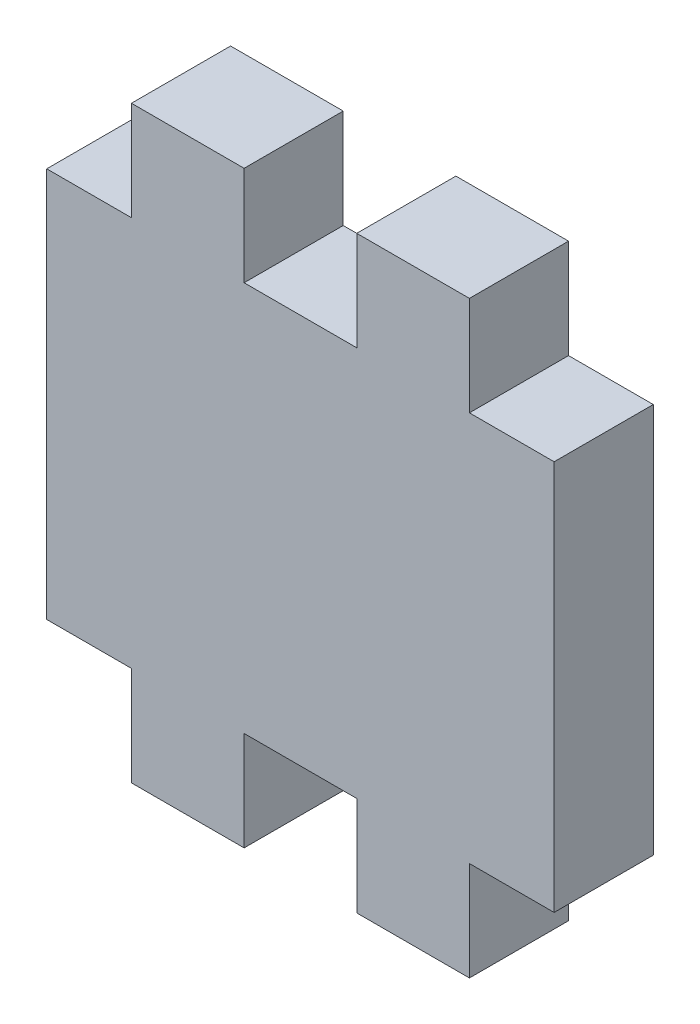
ISO-10303-21;
HEADER;
FILE_DESCRIPTION(('STEP AP214'),'2;1');
FILE_NAME('part.step','',(''),(''),'','','');
FILE_SCHEMA(('AUTOMOTIVE_DESIGN { 1 0 10303 214 1 1 1 1 }'));
ENDSEC;
DATA;
#1=APPLICATION_CONTEXT('core data for automotive mechanical design processes');
#2=APPLICATION_PROTOCOL_DEFINITION('international standard','automotive_design',2000,#1);
#3=PRODUCT_CONTEXT('',#1,'mechanical');
#4=PRODUCT('Part','Part','',(#3));
#5=PRODUCT_RELATED_PRODUCT_CATEGORY('part','',(#4));
#6=PRODUCT_DEFINITION_FORMATION('','',#4);
#7=PRODUCT_DEFINITION_CONTEXT('part definition',#1,'design');
#8=PRODUCT_DEFINITION('design','',#6,#7);
#9=PRODUCT_DEFINITION_SHAPE('','',#8);
#10=(LENGTH_UNIT() NAMED_UNIT(*) SI_UNIT(.MILLI.,.METRE.));
#11=(NAMED_UNIT(*) PLANE_ANGLE_UNIT() SI_UNIT($,.RADIAN.));
#12=(NAMED_UNIT(*) SI_UNIT($,.STERADIAN.) SOLID_ANGLE_UNIT());
#13=UNCERTAINTY_MEASURE_WITH_UNIT(LENGTH_MEASURE(1.E-05),#10,'distance_accuracy_value','');
#14=(GEOMETRIC_REPRESENTATION_CONTEXT(3) GLOBAL_UNCERTAINTY_ASSIGNED_CONTEXT((#13)) GLOBAL_UNIT_ASSIGNED_CONTEXT((#10,
#11,#12)) REPRESENTATION_CONTEXT('',''));
#15=CARTESIAN_POINT('',(0.,0.,0.));
#16=DIRECTION('',(0.,0.,1.));
#17=DIRECTION('',(1.,0.,0.));
#18=AXIS2_PLACEMENT_3D('',#15,#16,#17);
#19=CARTESIAN_POINT('',(0.,0.,5.588));
#20=DIRECTION('',(1.,0.,0.));
#21=DIRECTION('',(0.,0.,-1.));
#22=AXIS2_PLACEMENT_3D('',#19,#20,#21);
#23=PLANE('',#22);
#24=DIRECTION('',(0.,-1.,0.));
#25=VECTOR('',#24,1.);
#26=CARTESIAN_POINT('',(0.,0.,0.));
#27=LINE('',#26,#25);
#28=CARTESIAN_POINT('',(0.,22.,0.));
#29=VERTEX_POINT('',#28);
#30=CARTESIAN_POINT('',(0.,0.,0.));
#31=VERTEX_POINT('',#30);
#32=EDGE_CURVE('E201',#29,#31,#27,.T.);
#33=ORIENTED_EDGE('',*,*,#32,.T.);
#34=DIRECTION('',(0.,0.,-1.));
#35=VECTOR('',#34,1.);
#36=CARTESIAN_POINT('',(0.,0.,5.588));
#37=LINE('',#36,#35);
#38=CARTESIAN_POINT('',(0.,0.,5.588));
#39=VERTEX_POINT('',#38);
#40=EDGE_CURVE('E11',#39,#31,#37,.T.);
#41=ORIENTED_EDGE('',*,*,#40,.F.);
#42=DIRECTION('',(0.,-1.,0.));
#43=VECTOR('',#42,1.);
#44=CARTESIAN_POINT('',(0.,0.,5.588));
#45=LINE('',#44,#43);
#46=CARTESIAN_POINT('',(0.,22.,5.588));
#47=VERTEX_POINT('',#46);
#48=EDGE_CURVE('E239',#47,#39,#45,.T.);
#49=ORIENTED_EDGE('',*,*,#48,.F.);
#50=DIRECTION('',(0.,0.,-1.));
#51=VECTOR('',#50,1.);
#52=CARTESIAN_POINT('',(0.,22.,5.588));
#53=LINE('',#52,#51);
#54=EDGE_CURVE('E197',#47,#29,#53,.T.);
#55=ORIENTED_EDGE('',*,*,#54,.T.);
#56=EDGE_LOOP('',(#33,#41,#49,#55));
#57=FACE_BOUND('',#56,.T.);
#58=ADVANCED_FACE('F33',(#57),#23,.F.);
#59=CARTESIAN_POINT('',(0.,0.,5.588));
#60=DIRECTION('',(0.,1.,0.));
#61=DIRECTION('',(-1.,0.,0.));
#62=AXIS2_PLACEMENT_3D('',#59,#60,#61);
#63=PLANE('',#62);
#64=DIRECTION('',(1.,0.,0.));
#65=VECTOR('',#64,1.);
#66=CARTESIAN_POINT('',(0.,0.,0.));
#67=LINE('',#66,#65);
#68=CARTESIAN_POINT('',(4.77500000000001,0.,0.));
#69=VERTEX_POINT('',#68);
#70=EDGE_CURVE('E204',#31,#69,#67,.T.);
#71=ORIENTED_EDGE('',*,*,#70,.T.);
#72=DIRECTION('',(0.,0.,-1.));
#73=VECTOR('',#72,1.);
#74=CARTESIAN_POINT('',(4.77500000000001,0.,5.588));
#75=LINE('',#74,#73);
#76=CARTESIAN_POINT('',(4.77500000000001,0.,5.588));
#77=VERTEX_POINT('',#76);
#78=EDGE_CURVE('E41',#77,#69,#75,.T.);
#79=ORIENTED_EDGE('',*,*,#78,.F.);
#80=DIRECTION('',(1.,0.,0.));
#81=VECTOR('',#80,1.);
#82=CARTESIAN_POINT('',(0.,0.,5.588));
#83=LINE('',#82,#81);
#84=EDGE_CURVE('E128',#39,#77,#83,.T.);
#85=ORIENTED_EDGE('',*,*,#84,.F.);
#86=ORIENTED_EDGE('',*,*,#40,.T.);
#87=EDGE_LOOP('',(#71,#79,#85,#86));
#88=FACE_BOUND('',#87,.T.);
#89=ADVANCED_FACE('F357',(#88),#63,.F.);
#90=CARTESIAN_POINT('',(4.77500000000001,0.,5.588));
#91=DIRECTION('',(1.,0.,0.));
#92=DIRECTION('',(0.,1.,0.));
#93=AXIS2_PLACEMENT_3D('',#90,#91,#92);
#94=PLANE('',#93);
#95=DIRECTION('',(0.,-1.,0.));
#96=VECTOR('',#95,1.);
#97=CARTESIAN_POINT('',(4.77500000000001,0.,0.));
#98=LINE('',#97,#96);
#99=CARTESIAN_POINT('',(4.77500000000001,-5.588,0.));
#100=VERTEX_POINT('',#99);
#101=EDGE_CURVE('E206',#69,#100,#98,.T.);
#102=ORIENTED_EDGE('',*,*,#101,.T.);
#103=DIRECTION('',(0.,0.,-1.));
#104=VECTOR('',#103,1.);
#105=CARTESIAN_POINT('',(4.77500000000001,-5.588,5.588));
#106=LINE('',#105,#104);
#107=CARTESIAN_POINT('',(4.77500000000001,-5.588,5.588));
#108=VERTEX_POINT('',#107);
#109=EDGE_CURVE('E282',#108,#100,#106,.T.);
#110=ORIENTED_EDGE('',*,*,#109,.F.);
#111=DIRECTION('',(0.,-1.,0.));
#112=VECTOR('',#111,1.);
#113=CARTESIAN_POINT('',(4.77500000000001,0.,5.588));
#114=LINE('',#113,#112);
#115=EDGE_CURVE('E290',#77,#108,#114,.T.);
#116=ORIENTED_EDGE('',*,*,#115,.F.);
#117=ORIENTED_EDGE('',*,*,#78,.T.);
#118=EDGE_LOOP('',(#102,#110,#116,#117));
#119=FACE_BOUND('',#118,.T.);
#120=ADVANCED_FACE('F288',(#119),#94,.F.);
#121=CARTESIAN_POINT('',(4.77500000000001,-5.588,5.588));
#122=DIRECTION('',(0.,1.,0.));
#123=DIRECTION('',(0.,0.,1.));
#124=AXIS2_PLACEMENT_3D('',#121,#122,#123);
#125=PLANE('',#124);
#126=DIRECTION('',(1.,0.,0.));
#127=VECTOR('',#126,1.);
#128=CARTESIAN_POINT('',(4.77500000000001,-5.588,0.));
#129=LINE('',#128,#127);
#130=CARTESIAN_POINT('',(11.125,-5.588,0.));
#131=VERTEX_POINT('',#130);
#132=EDGE_CURVE('E208',#100,#131,#129,.T.);
#133=ORIENTED_EDGE('',*,*,#132,.T.);
#134=DIRECTION('',(0.,0.,-1.));
#135=VECTOR('',#134,1.);
#136=CARTESIAN_POINT('',(11.125,-5.588,5.588));
#137=LINE('',#136,#135);
#138=CARTESIAN_POINT('',(11.125,-5.588,5.588));
#139=VERTEX_POINT('',#138);
#140=EDGE_CURVE('E279',#139,#131,#137,.T.);
#141=ORIENTED_EDGE('',*,*,#140,.F.);
#142=DIRECTION('',(1.,0.,0.));
#143=VECTOR('',#142,1.);
#144=CARTESIAN_POINT('',(4.77500000000001,-5.588,5.588));
#145=LINE('',#144,#143);
#146=EDGE_CURVE('E308',#108,#139,#145,.T.);
#147=ORIENTED_EDGE('',*,*,#146,.F.);
#148=ORIENTED_EDGE('',*,*,#109,.T.);
#149=EDGE_LOOP('',(#133,#141,#147,#148));
#150=FACE_BOUND('',#149,.T.);
#151=ADVANCED_FACE('F299',(#150),#125,.F.);
#152=CARTESIAN_POINT('',(11.125,0.,5.588));
#153=DIRECTION('',(-1.,0.,0.));
#154=DIRECTION('',(0.,0.,1.));
#155=AXIS2_PLACEMENT_3D('',#152,#153,#154);
#156=PLANE('',#155);
#157=DIRECTION('',(0.,1.,0.));
#158=VECTOR('',#157,1.);
#159=CARTESIAN_POINT('',(11.125,0.,0.));
#160=LINE('',#159,#158);
#161=CARTESIAN_POINT('',(11.125,0.,0.));
#162=VERTEX_POINT('',#161);
#163=EDGE_CURVE('E210',#131,#162,#160,.T.);
#164=ORIENTED_EDGE('',*,*,#163,.T.);
#165=DIRECTION('',(0.,0.,-1.));
#166=VECTOR('',#165,1.);
#167=CARTESIAN_POINT('',(11.125,0.,5.588));
#168=LINE('',#167,#166);
#169=CARTESIAN_POINT('',(11.125,0.,5.588));
#170=VERTEX_POINT('',#169);
#171=EDGE_CURVE('E276',#170,#162,#168,.T.);
#172=ORIENTED_EDGE('',*,*,#171,.F.);
#173=DIRECTION('',(0.,1.,0.));
#174=VECTOR('',#173,1.);
#175=CARTESIAN_POINT('',(11.125,0.,5.588));
#176=LINE('',#175,#174);
#177=EDGE_CURVE('E305',#139,#170,#176,.T.);
#178=ORIENTED_EDGE('',*,*,#177,.F.);
#179=ORIENTED_EDGE('',*,*,#140,.T.);
#180=EDGE_LOOP('',(#164,#172,#178,#179));
#181=FACE_BOUND('',#180,.T.);
#182=ADVANCED_FACE('F303',(#181),#156,.F.);
#183=CARTESIAN_POINT('',(11.125,0.,5.588));
#184=DIRECTION('',(0.,1.,0.));
#185=DIRECTION('',(0.,0.,1.));
#186=AXIS2_PLACEMENT_3D('',#183,#184,#185);
#187=PLANE('',#186);
#188=DIRECTION('',(1.,0.,0.));
#189=VECTOR('',#188,1.);
#190=CARTESIAN_POINT('',(11.125,0.,0.));
#191=LINE('',#190,#189);
#192=CARTESIAN_POINT('',(17.475,0.,0.));
#193=VERTEX_POINT('',#192);
#194=EDGE_CURVE('E212',#162,#193,#191,.T.);
#195=ORIENTED_EDGE('',*,*,#194,.T.);
#196=DIRECTION('',(0.,0.,-1.));
#197=VECTOR('',#196,1.);
#198=CARTESIAN_POINT('',(17.475,0.,5.588));
#199=LINE('',#198,#197);
#200=CARTESIAN_POINT('',(17.475,0.,5.588));
#201=VERTEX_POINT('',#200);
#202=EDGE_CURVE('E273',#201,#193,#199,.T.);
#203=ORIENTED_EDGE('',*,*,#202,.F.);
#204=DIRECTION('',(1.,0.,0.));
#205=VECTOR('',#204,1.);
#206=CARTESIAN_POINT('',(11.125,0.,5.588));
#207=LINE('',#206,#205);
#208=EDGE_CURVE('E307',#170,#201,#207,.T.);
#209=ORIENTED_EDGE('',*,*,#208,.F.);
#210=ORIENTED_EDGE('',*,*,#171,.T.);
#211=EDGE_LOOP('',(#195,#203,#209,#210));
#212=FACE_BOUND('',#211,.T.);
#213=ADVANCED_FACE('F370',(#212),#187,.F.);
#214=CARTESIAN_POINT('',(17.475,0.,5.588));
#215=DIRECTION('',(1.,0.,0.));
#216=DIRECTION('',(0.,0.,-1.));
#217=AXIS2_PLACEMENT_3D('',#214,#215,#216);
#218=PLANE('',#217);
#219=DIRECTION('',(0.,-1.,0.));
#220=VECTOR('',#219,1.);
#221=CARTESIAN_POINT('',(17.475,0.,0.));
#222=LINE('',#221,#220);
#223=CARTESIAN_POINT('',(17.475,-5.588,0.));
#224=VERTEX_POINT('',#223);
#225=EDGE_CURVE('E214',#193,#224,#222,.T.);
#226=ORIENTED_EDGE('',*,*,#225,.T.);
#227=DIRECTION('',(0.,0.,-1.));
#228=VECTOR('',#227,1.);
#229=CARTESIAN_POINT('',(17.475,-5.588,5.588));
#230=LINE('',#229,#228);
#231=CARTESIAN_POINT('',(17.475,-5.588,5.588));
#232=VERTEX_POINT('',#231);
#233=EDGE_CURVE('E270',#232,#224,#230,.T.);
#234=ORIENTED_EDGE('',*,*,#233,.F.);
#235=DIRECTION('',(0.,-1.,0.));
#236=VECTOR('',#235,1.);
#237=CARTESIAN_POINT('',(17.475,0.,5.588));
#238=LINE('',#237,#236);
#239=EDGE_CURVE('E310',#201,#232,#238,.T.);
#240=ORIENTED_EDGE('',*,*,#239,.F.);
#241=ORIENTED_EDGE('',*,*,#202,.T.);
#242=EDGE_LOOP('',(#226,#234,#240,#241));
#243=FACE_BOUND('',#242,.T.);
#244=ADVANCED_FACE('F373',(#243),#218,.F.);
#245=CARTESIAN_POINT('',(17.475,-5.588,5.588));
#246=DIRECTION('',(0.,1.,0.));
#247=DIRECTION('',(0.,0.,1.));
#248=AXIS2_PLACEMENT_3D('',#245,#246,#247);
#249=PLANE('',#248);
#250=DIRECTION('',(1.,0.,0.));
#251=VECTOR('',#250,1.);
#252=CARTESIAN_POINT('',(17.475,-5.588,0.));
#253=LINE('',#252,#251);
#254=CARTESIAN_POINT('',(23.825,-5.588,0.));
#255=VERTEX_POINT('',#254);
#256=EDGE_CURVE('E216',#224,#255,#253,.T.);
#257=ORIENTED_EDGE('',*,*,#256,.T.);
#258=DIRECTION('',(0.,0.,-1.));
#259=VECTOR('',#258,1.);
#260=CARTESIAN_POINT('',(23.825,-5.588,5.588));
#261=LINE('',#260,#259);
#262=CARTESIAN_POINT('',(23.825,-5.588,5.588));
#263=VERTEX_POINT('',#262);
#264=EDGE_CURVE('E267',#263,#255,#261,.T.);
#265=ORIENTED_EDGE('',*,*,#264,.F.);
#266=DIRECTION('',(1.,0.,0.));
#267=VECTOR('',#266,1.);
#268=CARTESIAN_POINT('',(17.475,-5.588,5.588));
#269=LINE('',#268,#267);
#270=EDGE_CURVE('E316',#232,#263,#269,.T.);
#271=ORIENTED_EDGE('',*,*,#270,.F.);
#272=ORIENTED_EDGE('',*,*,#233,.T.);
#273=EDGE_LOOP('',(#257,#265,#271,#272));
#274=FACE_BOUND('',#273,.T.);
#275=ADVANCED_FACE('F377',(#274),#249,.F.);
#276=CARTESIAN_POINT('',(23.825,0.,5.588));
#277=DIRECTION('',(-1.,0.,0.));
#278=DIRECTION('',(0.,0.,1.));
#279=AXIS2_PLACEMENT_3D('',#276,#277,#278);
#280=PLANE('',#279);
#281=DIRECTION('',(0.,1.,0.));
#282=VECTOR('',#281,1.);
#283=CARTESIAN_POINT('',(23.825,0.,0.));
#284=LINE('',#283,#282);
#285=CARTESIAN_POINT('',(23.825,0.,0.));
#286=VERTEX_POINT('',#285);
#287=EDGE_CURVE('E218',#255,#286,#284,.T.);
#288=ORIENTED_EDGE('',*,*,#287,.T.);
#289=DIRECTION('',(0.,0.,-1.));
#290=VECTOR('',#289,1.);
#291=CARTESIAN_POINT('',(23.825,0.,5.588));
#292=LINE('',#291,#290);
#293=CARTESIAN_POINT('',(23.825,0.,5.588));
#294=VERTEX_POINT('',#293);
#295=EDGE_CURVE('E264',#294,#286,#292,.T.);
#296=ORIENTED_EDGE('',*,*,#295,.F.);
#297=DIRECTION('',(0.,1.,0.));
#298=VECTOR('',#297,1.);
#299=CARTESIAN_POINT('',(23.825,0.,5.588));
#300=LINE('',#299,#298);
#301=EDGE_CURVE('E318',#263,#294,#300,.T.);
#302=ORIENTED_EDGE('',*,*,#301,.F.);
#303=ORIENTED_EDGE('',*,*,#264,.T.);
#304=EDGE_LOOP('',(#288,#296,#302,#303));
#305=FACE_BOUND('',#304,.T.);
#306=ADVANCED_FACE('F381',(#305),#280,.F.);
#307=CARTESIAN_POINT('',(23.825,0.,5.588));
#308=DIRECTION('',(0.,1.,0.));
#309=DIRECTION('',(-1.,0.,0.));
#310=AXIS2_PLACEMENT_3D('',#307,#308,#309);
#311=PLANE('',#310);
#312=DIRECTION('',(1.,0.,0.));
#313=VECTOR('',#312,1.);
#314=CARTESIAN_POINT('',(23.825,0.,0.));
#315=LINE('',#314,#313);
#316=CARTESIAN_POINT('',(28.6,0.,0.));
#317=VERTEX_POINT('',#316);
#318=EDGE_CURVE('E220',#286,#317,#315,.T.);
#319=ORIENTED_EDGE('',*,*,#318,.T.);
#320=DIRECTION('',(0.,0.,-1.));
#321=VECTOR('',#320,1.);
#322=CARTESIAN_POINT('',(28.6,0.,5.588));
#323=LINE('',#322,#321);
#324=CARTESIAN_POINT('',(28.6,0.,5.588));
#325=VERTEX_POINT('',#324);
#326=EDGE_CURVE('E261',#325,#317,#323,.T.);
#327=ORIENTED_EDGE('',*,*,#326,.F.);
#328=DIRECTION('',(1.,0.,0.));
#329=VECTOR('',#328,1.);
#330=CARTESIAN_POINT('',(23.825,0.,5.588));
#331=LINE('',#330,#329);
#332=EDGE_CURVE('E320',#294,#325,#331,.T.);
#333=ORIENTED_EDGE('',*,*,#332,.F.);
#334=ORIENTED_EDGE('',*,*,#295,.T.);
#335=EDGE_LOOP('',(#319,#327,#333,#334));
#336=FACE_BOUND('',#335,.T.);
#337=ADVANCED_FACE('F385',(#336),#311,.F.);
#338=CARTESIAN_POINT('',(28.6,0.,5.588));
#339=DIRECTION('',(-1.,0.,0.));
#340=DIRECTION('',(0.,0.,1.));
#341=AXIS2_PLACEMENT_3D('',#338,#339,#340);
#342=PLANE('',#341);
#343=DIRECTION('',(0.,1.,0.));
#344=VECTOR('',#343,1.);
#345=CARTESIAN_POINT('',(28.6,0.,0.));
#346=LINE('',#345,#344);
#347=CARTESIAN_POINT('',(28.6,22.,0.));
#348=VERTEX_POINT('',#347);
#349=EDGE_CURVE('E222',#317,#348,#346,.T.);
#350=ORIENTED_EDGE('',*,*,#349,.T.);
#351=DIRECTION('',(0.,0.,-1.));
#352=VECTOR('',#351,1.);
#353=CARTESIAN_POINT('',(28.6,22.,5.588));
#354=LINE('',#353,#352);
#355=CARTESIAN_POINT('',(28.6,22.,5.588));
#356=VERTEX_POINT('',#355);
#357=EDGE_CURVE('E258',#356,#348,#354,.T.);
#358=ORIENTED_EDGE('',*,*,#357,.F.);
#359=DIRECTION('',(0.,1.,0.));
#360=VECTOR('',#359,1.);
#361=CARTESIAN_POINT('',(28.6,0.,5.588));
#362=LINE('',#361,#360);
#363=EDGE_CURVE('E322',#325,#356,#362,.T.);
#364=ORIENTED_EDGE('',*,*,#363,.F.);
#365=ORIENTED_EDGE('',*,*,#326,.T.);
#366=EDGE_LOOP('',(#350,#358,#364,#365));
#367=FACE_BOUND('',#366,.T.);
#368=ADVANCED_FACE('F389',(#367),#342,.F.);
#369=CARTESIAN_POINT('',(23.825,22.,5.588));
#370=DIRECTION('',(0.,-1.,0.));
#371=DIRECTION('',(1.,0.,0.));
#372=AXIS2_PLACEMENT_3D('',#369,#370,#371);
#373=PLANE('',#372);
#374=DIRECTION('',(-1.,0.,0.));
#375=VECTOR('',#374,1.);
#376=CARTESIAN_POINT('',(23.825,22.,0.));
#377=LINE('',#376,#375);
#378=CARTESIAN_POINT('',(23.825,22.,0.));
#379=VERTEX_POINT('',#378);
#380=EDGE_CURVE('E224',#348,#379,#377,.T.);
#381=ORIENTED_EDGE('',*,*,#380,.T.);
#382=DIRECTION('',(0.,0.,-1.));
#383=VECTOR('',#382,1.);
#384=CARTESIAN_POINT('',(23.825,22.,5.588));
#385=LINE('',#384,#383);
#386=CARTESIAN_POINT('',(23.825,22.,5.588));
#387=VERTEX_POINT('',#386);
#388=EDGE_CURVE('E255',#387,#379,#385,.T.);
#389=ORIENTED_EDGE('',*,*,#388,.F.);
#390=DIRECTION('',(-1.,0.,0.));
#391=VECTOR('',#390,1.);
#392=CARTESIAN_POINT('',(23.825,22.,5.588));
#393=LINE('',#392,#391);
#394=EDGE_CURVE('E324',#356,#387,#393,.T.);
#395=ORIENTED_EDGE('',*,*,#394,.F.);
#396=ORIENTED_EDGE('',*,*,#357,.T.);
#397=EDGE_LOOP('',(#381,#389,#395,#396));
#398=FACE_BOUND('',#397,.T.);
#399=ADVANCED_FACE('F393',(#398),#373,.F.);
#400=CARTESIAN_POINT('',(23.825,22.,5.588));
#401=DIRECTION('',(-1.,0.,0.));
#402=DIRECTION('',(0.,0.,1.));
#403=AXIS2_PLACEMENT_3D('',#400,#401,#402);
#404=PLANE('',#403);
#405=DIRECTION('',(0.,1.,0.));
#406=VECTOR('',#405,1.);
#407=CARTESIAN_POINT('',(23.825,22.,0.));
#408=LINE('',#407,#406);
#409=CARTESIAN_POINT('',(23.825,27.588,0.));
#410=VERTEX_POINT('',#409);
#411=EDGE_CURVE('E226',#379,#410,#408,.T.);
#412=ORIENTED_EDGE('',*,*,#411,.T.);
#413=DIRECTION('',(0.,0.,-1.));
#414=VECTOR('',#413,1.);
#415=CARTESIAN_POINT('',(23.825,27.588,5.588));
#416=LINE('',#415,#414);
#417=CARTESIAN_POINT('',(23.825,27.588,5.588));
#418=VERTEX_POINT('',#417);
#419=EDGE_CURVE('E252',#418,#410,#416,.T.);
#420=ORIENTED_EDGE('',*,*,#419,.F.);
#421=DIRECTION('',(0.,1.,0.));
#422=VECTOR('',#421,1.);
#423=CARTESIAN_POINT('',(23.825,22.,5.588));
#424=LINE('',#423,#422);
#425=EDGE_CURVE('E326',#387,#418,#424,.T.);
#426=ORIENTED_EDGE('',*,*,#425,.F.);
#427=ORIENTED_EDGE('',*,*,#388,.T.);
#428=EDGE_LOOP('',(#412,#420,#426,#427));
#429=FACE_BOUND('',#428,.T.);
#430=ADVANCED_FACE('F397',(#429),#404,.F.);
#431=CARTESIAN_POINT('',(17.475,27.588,5.588));
#432=DIRECTION('',(0.,-1.,0.));
#433=DIRECTION('',(0.,0.,-1.));
#434=AXIS2_PLACEMENT_3D('',#431,#432,#433);
#435=PLANE('',#434);
#436=DIRECTION('',(-1.,0.,0.));
#437=VECTOR('',#436,1.);
#438=CARTESIAN_POINT('',(17.475,27.588,0.));
#439=LINE('',#438,#437);
#440=CARTESIAN_POINT('',(17.475,27.588,0.));
#441=VERTEX_POINT('',#440);
#442=EDGE_CURVE('E228',#410,#441,#439,.T.);
#443=ORIENTED_EDGE('',*,*,#442,.T.);
#444=DIRECTION('',(0.,0.,-1.));
#445=VECTOR('',#444,1.);
#446=CARTESIAN_POINT('',(17.475,27.588,5.588));
#447=LINE('',#446,#445);
#448=CARTESIAN_POINT('',(17.475,27.588,5.588));
#449=VERTEX_POINT('',#448);
#450=EDGE_CURVE('E249',#449,#441,#447,.T.);
#451=ORIENTED_EDGE('',*,*,#450,.F.);
#452=DIRECTION('',(-1.,0.,0.));
#453=VECTOR('',#452,1.);
#454=CARTESIAN_POINT('',(17.475,27.588,5.588));
#455=LINE('',#454,#453);
#456=EDGE_CURVE('E328',#418,#449,#455,.T.);
#457=ORIENTED_EDGE('',*,*,#456,.F.);
#458=ORIENTED_EDGE('',*,*,#419,.T.);
#459=EDGE_LOOP('',(#443,#451,#457,#458));
#460=FACE_BOUND('',#459,.T.);
#461=ADVANCED_FACE('F401',(#460),#435,.F.);
#462=CARTESIAN_POINT('',(17.475,22.,5.588));
#463=DIRECTION('',(1.,0.,0.));
#464=DIRECTION('',(0.,0.,-1.));
#465=AXIS2_PLACEMENT_3D('',#462,#463,#464);
#466=PLANE('',#465);
#467=DIRECTION('',(0.,-1.,0.));
#468=VECTOR('',#467,1.);
#469=CARTESIAN_POINT('',(17.475,22.,0.));
#470=LINE('',#469,#468);
#471=CARTESIAN_POINT('',(17.475,22.,0.));
#472=VERTEX_POINT('',#471);
#473=EDGE_CURVE('E230',#441,#472,#470,.T.);
#474=ORIENTED_EDGE('',*,*,#473,.T.);
#475=DIRECTION('',(0.,0.,-1.));
#476=VECTOR('',#475,1.);
#477=CARTESIAN_POINT('',(17.475,22.,5.588));
#478=LINE('',#477,#476);
#479=CARTESIAN_POINT('',(17.475,22.,5.588));
#480=VERTEX_POINT('',#479);
#481=EDGE_CURVE('E246',#480,#472,#478,.T.);
#482=ORIENTED_EDGE('',*,*,#481,.F.);
#483=DIRECTION('',(0.,-1.,0.));
#484=VECTOR('',#483,1.);
#485=CARTESIAN_POINT('',(17.475,22.,5.588));
#486=LINE('',#485,#484);
#487=EDGE_CURVE('E330',#449,#480,#486,.T.);
#488=ORIENTED_EDGE('',*,*,#487,.F.);
#489=ORIENTED_EDGE('',*,*,#450,.T.);
#490=EDGE_LOOP('',(#474,#482,#488,#489));
#491=FACE_BOUND('',#490,.T.);
#492=ADVANCED_FACE('F405',(#491),#466,.F.);
#493=CARTESIAN_POINT('',(11.125,22.,5.588));
#494=DIRECTION('',(0.,-1.,0.));
#495=DIRECTION('',(0.,0.,-1.));
#496=AXIS2_PLACEMENT_3D('',#493,#494,#495);
#497=PLANE('',#496);
#498=DIRECTION('',(-1.,0.,0.));
#499=VECTOR('',#498,1.);
#500=CARTESIAN_POINT('',(11.125,22.,0.));
#501=LINE('',#500,#499);
#502=CARTESIAN_POINT('',(11.125,22.,0.));
#503=VERTEX_POINT('',#502);
#504=EDGE_CURVE('E232',#472,#503,#501,.T.);
#505=ORIENTED_EDGE('',*,*,#504,.T.);
#506=DIRECTION('',(0.,0.,-1.));
#507=VECTOR('',#506,1.);
#508=CARTESIAN_POINT('',(11.125,22.,5.588));
#509=LINE('',#508,#507);
#510=CARTESIAN_POINT('',(11.125,22.,5.588));
#511=VERTEX_POINT('',#510);
#512=EDGE_CURVE('E243',#511,#503,#509,.T.);
#513=ORIENTED_EDGE('',*,*,#512,.F.);
#514=DIRECTION('',(-1.,0.,0.));
#515=VECTOR('',#514,1.);
#516=CARTESIAN_POINT('',(11.125,22.,5.588));
#517=LINE('',#516,#515);
#518=EDGE_CURVE('E332',#480,#511,#517,.T.);
#519=ORIENTED_EDGE('',*,*,#518,.F.);
#520=ORIENTED_EDGE('',*,*,#481,.T.);
#521=EDGE_LOOP('',(#505,#513,#519,#520));
#522=FACE_BOUND('',#521,.T.);
#523=ADVANCED_FACE('F338',(#522),#497,.F.);
#524=CARTESIAN_POINT('',(11.125,22.,5.588));
#525=DIRECTION('',(-1.,0.,0.));
#526=DIRECTION('',(0.,-1.,0.));
#527=AXIS2_PLACEMENT_3D('',#524,#525,#526);
#528=PLANE('',#527);
#529=DIRECTION('',(0.,1.,0.));
#530=VECTOR('',#529,1.);
#531=CARTESIAN_POINT('',(11.125,22.,0.));
#532=LINE('',#531,#530);
#533=CARTESIAN_POINT('',(11.125,27.588,0.));
#534=VERTEX_POINT('',#533);
#535=EDGE_CURVE('E234',#503,#534,#532,.T.);
#536=ORIENTED_EDGE('',*,*,#535,.T.);
#537=DIRECTION('',(0.,0.,-1.));
#538=VECTOR('',#537,1.);
#539=CARTESIAN_POINT('',(11.125,27.588,5.588));
#540=LINE('',#539,#538);
#541=CARTESIAN_POINT('',(11.125,27.588,5.588));
#542=VERTEX_POINT('',#541);
#543=EDGE_CURVE('E192',#542,#534,#540,.T.);
#544=ORIENTED_EDGE('',*,*,#543,.F.);
#545=DIRECTION('',(0.,1.,0.));
#546=VECTOR('',#545,1.);
#547=CARTESIAN_POINT('',(11.125,22.,5.588));
#548=LINE('',#547,#546);
#549=EDGE_CURVE('E183',#511,#542,#548,.T.);
#550=ORIENTED_EDGE('',*,*,#549,.F.);
#551=ORIENTED_EDGE('',*,*,#512,.T.);
#552=EDGE_LOOP('',(#536,#544,#550,#551));
#553=FACE_BOUND('',#552,.T.);
#554=ADVANCED_FACE('F342',(#553),#528,.F.);
#555=CARTESIAN_POINT('',(4.77500000000001,27.588,5.588));
#556=DIRECTION('',(0.,-1.,0.));
#557=DIRECTION('',(0.,0.,-1.));
#558=AXIS2_PLACEMENT_3D('',#555,#556,#557);
#559=PLANE('',#558);
#560=DIRECTION('',(-1.,0.,0.));
#561=VECTOR('',#560,1.);
#562=CARTESIAN_POINT('',(4.77500000000001,27.588,0.));
#563=LINE('',#562,#561);
#564=CARTESIAN_POINT('',(4.77500000000001,27.588,0.));
#565=VERTEX_POINT('',#564);
#566=EDGE_CURVE('E191',#534,#565,#563,.T.);
#567=ORIENTED_EDGE('',*,*,#566,.T.);
#568=DIRECTION('',(0.,0.,-1.));
#569=VECTOR('',#568,1.);
#570=CARTESIAN_POINT('',(4.77500000000001,27.588,5.588));
#571=LINE('',#570,#569);
#572=CARTESIAN_POINT('',(4.77500000000001,27.588,5.588));
#573=VERTEX_POINT('',#572);
#574=EDGE_CURVE('E188',#573,#565,#571,.T.);
#575=ORIENTED_EDGE('',*,*,#574,.F.);
#576=DIRECTION('',(-1.,0.,0.));
#577=VECTOR('',#576,1.);
#578=CARTESIAN_POINT('',(4.77500000000001,27.588,5.588));
#579=LINE('',#578,#577);
#580=EDGE_CURVE('E177',#542,#573,#579,.T.);
#581=ORIENTED_EDGE('',*,*,#580,.F.);
#582=ORIENTED_EDGE('',*,*,#543,.T.);
#583=EDGE_LOOP('',(#567,#575,#581,#582));
#584=FACE_BOUND('',#583,.T.);
#585=ADVANCED_FACE('F189',(#584),#559,.F.);
#586=CARTESIAN_POINT('',(4.77500000000001,22.,5.588));
#587=DIRECTION('',(1.,0.,0.));
#588=DIRECTION('',(0.,1.,0.));
#589=AXIS2_PLACEMENT_3D('',#586,#587,#588);
#590=PLANE('',#589);
#591=DIRECTION('',(0.,-1.,0.));
#592=VECTOR('',#591,1.);
#593=CARTESIAN_POINT('',(4.77500000000001,22.,0.));
#594=LINE('',#593,#592);
#595=CARTESIAN_POINT('',(4.77500000000001,22.,0.));
#596=VERTEX_POINT('',#595);
#597=EDGE_CURVE('E114',#565,#596,#594,.T.);
#598=ORIENTED_EDGE('',*,*,#597,.T.);
#599=DIRECTION('',(0.,0.,-1.));
#600=VECTOR('',#599,1.);
#601=CARTESIAN_POINT('',(4.77500000000001,22.,5.588));
#602=LINE('',#601,#600);
#603=CARTESIAN_POINT('',(4.77500000000001,22.,5.588));
#604=VERTEX_POINT('',#603);
#605=EDGE_CURVE('E193',#604,#596,#602,.T.);
#606=ORIENTED_EDGE('',*,*,#605,.F.);
#607=DIRECTION('',(0.,-1.,0.));
#608=VECTOR('',#607,1.);
#609=CARTESIAN_POINT('',(4.77500000000001,22.,5.588));
#610=LINE('',#609,#608);
#611=EDGE_CURVE('E181',#573,#604,#610,.T.);
#612=ORIENTED_EDGE('',*,*,#611,.F.);
#613=ORIENTED_EDGE('',*,*,#574,.T.);
#614=EDGE_LOOP('',(#598,#606,#612,#613));
#615=FACE_BOUND('',#614,.T.);
#616=ADVANCED_FACE('F195',(#615),#590,.F.);
#617=CARTESIAN_POINT('',(0.,22.,5.588));
#618=DIRECTION('',(0.,-1.,0.));
#619=DIRECTION('',(1.,0.,0.));
#620=AXIS2_PLACEMENT_3D('',#617,#618,#619);
#621=PLANE('',#620);
#622=DIRECTION('',(-1.,0.,0.));
#623=VECTOR('',#622,1.);
#624=CARTESIAN_POINT('',(0.,22.,0.));
#625=LINE('',#624,#623);
#626=EDGE_CURVE('E120',#596,#29,#625,.T.);
#627=ORIENTED_EDGE('',*,*,#626,.T.);
#628=ORIENTED_EDGE('',*,*,#54,.F.);
#629=DIRECTION('',(-1.,0.,0.));
#630=VECTOR('',#629,1.);
#631=CARTESIAN_POINT('',(0.,22.,5.588));
#632=LINE('',#631,#630);
#633=EDGE_CURVE('E49',#604,#47,#632,.T.);
#634=ORIENTED_EDGE('',*,*,#633,.F.);
#635=ORIENTED_EDGE('',*,*,#605,.T.);
#636=EDGE_LOOP('',(#627,#628,#634,#635));
#637=FACE_BOUND('',#636,.T.);
#638=ADVANCED_FACE('F346',(#637),#621,.F.);
#639=CARTESIAN_POINT('',(0.,0.,5.588));
#640=DIRECTION('',(0.,0.,-1.));
#641=DIRECTION('',(-1.,0.,0.));
#642=AXIS2_PLACEMENT_3D('',#639,#640,#641);
#643=PLANE('',#642);
#644=ORIENTED_EDGE('',*,*,#48,.T.);
#645=ORIENTED_EDGE('',*,*,#84,.T.);
#646=ORIENTED_EDGE('',*,*,#115,.T.);
#647=ORIENTED_EDGE('',*,*,#146,.T.);
#648=ORIENTED_EDGE('',*,*,#177,.T.);
#649=ORIENTED_EDGE('',*,*,#208,.T.);
#650=ORIENTED_EDGE('',*,*,#239,.T.);
#651=ORIENTED_EDGE('',*,*,#270,.T.);
#652=ORIENTED_EDGE('',*,*,#301,.T.);
#653=ORIENTED_EDGE('',*,*,#332,.T.);
#654=ORIENTED_EDGE('',*,*,#363,.T.);
#655=ORIENTED_EDGE('',*,*,#394,.T.);
#656=ORIENTED_EDGE('',*,*,#425,.T.);
#657=ORIENTED_EDGE('',*,*,#456,.T.);
#658=ORIENTED_EDGE('',*,*,#487,.T.);
#659=ORIENTED_EDGE('',*,*,#518,.T.);
#660=ORIENTED_EDGE('',*,*,#549,.T.);
#661=ORIENTED_EDGE('',*,*,#580,.T.);
#662=ORIENTED_EDGE('',*,*,#611,.T.);
#663=ORIENTED_EDGE('',*,*,#633,.T.);
#664=EDGE_LOOP('',(#644,#645,#646,#647,#648,#649,#650,#651,#652,#653,#654,#655,#656,#657,#658,
#659,#660,#661,#662,#663));
#665=FACE_BOUND('',#664,.T.);
#666=ADVANCED_FACE('F179',(#665),#643,.F.);
#667=CARTESIAN_POINT('',(0.,0.,0.));
#668=DIRECTION('',(0.,0.,-1.));
#669=DIRECTION('',(-1.,0.,0.));
#670=AXIS2_PLACEMENT_3D('',#667,#668,#669);
#671=PLANE('',#670);
#672=ORIENTED_EDGE('',*,*,#32,.F.);
#673=ORIENTED_EDGE('',*,*,#626,.F.);
#674=ORIENTED_EDGE('',*,*,#597,.F.);
#675=ORIENTED_EDGE('',*,*,#566,.F.);
#676=ORIENTED_EDGE('',*,*,#535,.F.);
#677=ORIENTED_EDGE('',*,*,#504,.F.);
#678=ORIENTED_EDGE('',*,*,#473,.F.);
#679=ORIENTED_EDGE('',*,*,#442,.F.);
#680=ORIENTED_EDGE('',*,*,#411,.F.);
#681=ORIENTED_EDGE('',*,*,#380,.F.);
#682=ORIENTED_EDGE('',*,*,#349,.F.);
#683=ORIENTED_EDGE('',*,*,#318,.F.);
#684=ORIENTED_EDGE('',*,*,#287,.F.);
#685=ORIENTED_EDGE('',*,*,#256,.F.);
#686=ORIENTED_EDGE('',*,*,#225,.F.);
#687=ORIENTED_EDGE('',*,*,#194,.F.);
#688=ORIENTED_EDGE('',*,*,#163,.F.);
#689=ORIENTED_EDGE('',*,*,#132,.F.);
#690=ORIENTED_EDGE('',*,*,#101,.F.);
#691=ORIENTED_EDGE('',*,*,#70,.F.);
#692=EDGE_LOOP('',(#672,#673,#674,#675,#676,#677,#678,#679,#680,#681,#682,#683,#684,#685,#686,
#687,#688,#689,#690,#691));
#693=FACE_BOUND('',#692,.T.);
#694=ADVANCED_FACE('F294',(#693),#671,.T.);
#695=CLOSED_SHELL('',(#58,#89,#120,#151,#182,#213,#244,#275,#306,#337,#368,#399,#430,#461,#492,
#523,#554,#585,#616,#638,#666,#694));
#696=MANIFOLD_SOLID_BREP('B2',#695);
#697=ADVANCED_BREP_SHAPE_REPRESENTATION('',(#18,#696),#14);
#698=SHAPE_DEFINITION_REPRESENTATION(#9,#697);
ENDSEC;
END-ISO-10303-21;
